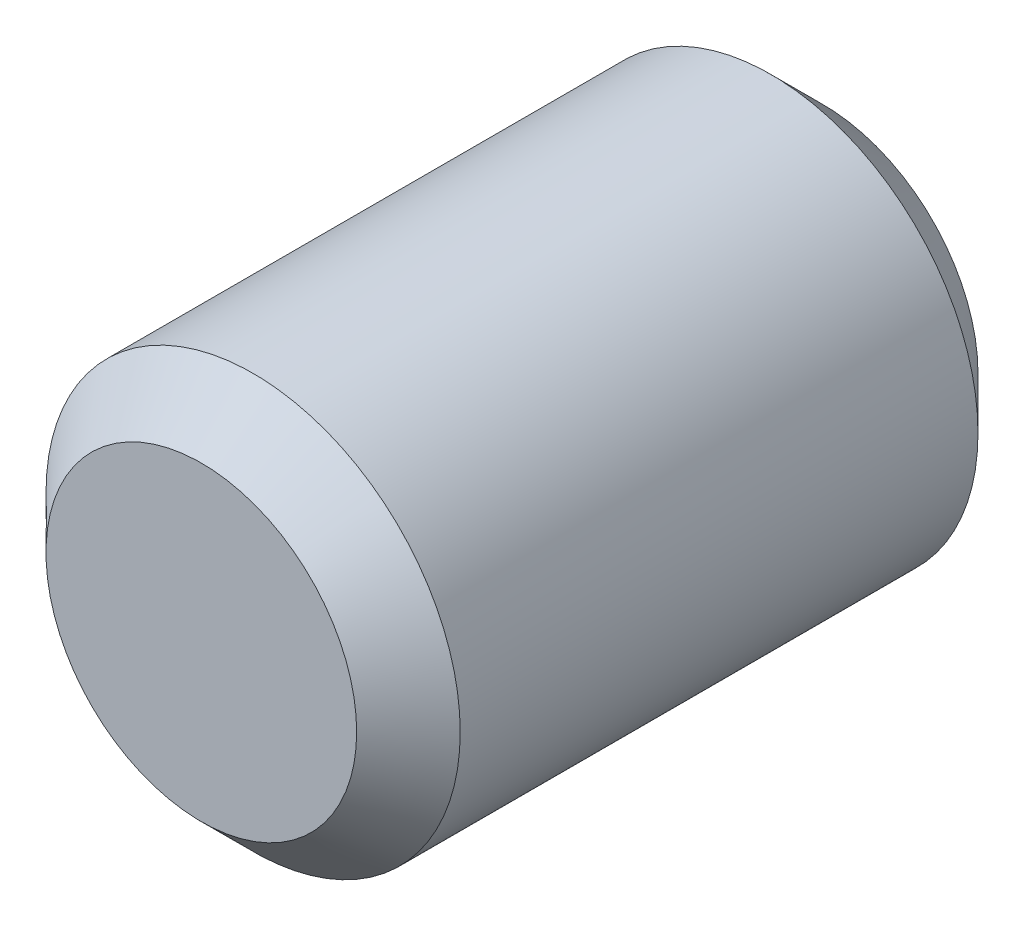
ISO-10303-21;
HEADER;
FILE_DESCRIPTION(('STEP AP214'),'2;1');
FILE_NAME('part.step','',(''),(''),'','','');
FILE_SCHEMA(('AUTOMOTIVE_DESIGN { 1 0 10303 214 1 1 1 1 }'));
ENDSEC;
DATA;
#1=APPLICATION_CONTEXT('core data for automotive mechanical design processes');
#2=APPLICATION_PROTOCOL_DEFINITION('international standard','automotive_design',2000,#1);
#3=PRODUCT_CONTEXT('',#1,'mechanical');
#4=PRODUCT('Part','Part','',(#3));
#5=PRODUCT_RELATED_PRODUCT_CATEGORY('part','',(#4));
#6=PRODUCT_DEFINITION_FORMATION('','',#4);
#7=PRODUCT_DEFINITION_CONTEXT('part definition',#1,'design');
#8=PRODUCT_DEFINITION('design','',#6,#7);
#9=PRODUCT_DEFINITION_SHAPE('','',#8);
#10=(LENGTH_UNIT() NAMED_UNIT(*) SI_UNIT(.MILLI.,.METRE.));
#11=(NAMED_UNIT(*) PLANE_ANGLE_UNIT() SI_UNIT($,.RADIAN.));
#12=(NAMED_UNIT(*) SI_UNIT($,.STERADIAN.) SOLID_ANGLE_UNIT());
#13=UNCERTAINTY_MEASURE_WITH_UNIT(LENGTH_MEASURE(1.E-05),#10,'distance_accuracy_value','');
#14=(GEOMETRIC_REPRESENTATION_CONTEXT(3) GLOBAL_UNCERTAINTY_ASSIGNED_CONTEXT((#13)) GLOBAL_UNIT_ASSIGNED_CONTEXT((#10,
#11,#12)) REPRESENTATION_CONTEXT('',''));
#15=CARTESIAN_POINT('',(0.,0.,0.));
#16=DIRECTION('',(0.,0.,1.));
#17=DIRECTION('',(1.,0.,0.));
#18=AXIS2_PLACEMENT_3D('',#15,#16,#17);
#19=CARTESIAN_POINT('',(0.,0.,6.));
#20=DIRECTION('',(0.,0.,-1.));
#21=DIRECTION('',(-1.,0.,0.));
#22=AXIS2_PLACEMENT_3D('',#19,#20,#21);
#23=CYLINDRICAL_SURFACE('',#22,2.);
#24=CARTESIAN_POINT('',(0.,0.,0.5));
#25=DIRECTION('',(0.,0.,1.));
#26=DIRECTION('',(1.,0.,0.));
#27=AXIS2_PLACEMENT_3D('',#24,#25,#26);
#28=CIRCLE('',#27,2.);
#29=CARTESIAN_POINT('',(2.,0.,0.5));
#30=VERTEX_POINT('',#29);
#31=EDGE_CURVE('E53',#30,#30,#28,.T.);
#32=ORIENTED_EDGE('',*,*,#31,.T.);
#33=EDGE_LOOP('',(#32));
#34=FACE_BOUND('',#33,.T.);
#35=CARTESIAN_POINT('',(0.,0.,5.5));
#36=DIRECTION('',(0.,0.,1.));
#37=DIRECTION('',(1.,0.,0.));
#38=AXIS2_PLACEMENT_3D('',#35,#36,#37);
#39=CIRCLE('',#38,2.);
#40=CARTESIAN_POINT('',(2.,0.,5.5));
#41=VERTEX_POINT('',#40);
#42=EDGE_CURVE('E58',#41,#41,#39,.F.);
#43=ORIENTED_EDGE('',*,*,#42,.T.);
#44=EDGE_LOOP('',(#43));
#45=FACE_BOUND('',#44,.T.);
#46=ADVANCED_FACE('F39',(#34,#45),#23,.T.);
#47=CARTESIAN_POINT('',(0.,0.,6.));
#48=DIRECTION('',(0.,0.,1.));
#49=DIRECTION('',(1.,0.,0.));
#50=AXIS2_PLACEMENT_3D('',#47,#48,#49);
#51=PLANE('',#50);
#52=CARTESIAN_POINT('',(0.,0.,6.));
#53=DIRECTION('',(0.,0.,1.));
#54=DIRECTION('',(1.,0.,0.));
#55=AXIS2_PLACEMENT_3D('',#52,#53,#54);
#56=CIRCLE('',#55,1.5);
#57=CARTESIAN_POINT('',(1.5,0.,6.));
#58=VERTEX_POINT('',#57);
#59=EDGE_CURVE('E10',#58,#58,#56,.T.);
#60=ORIENTED_EDGE('',*,*,#59,.T.);
#61=EDGE_LOOP('',(#60));
#62=FACE_BOUND('',#61,.T.);
#63=ADVANCED_FACE('F75',(#62),#51,.T.);
#64=CARTESIAN_POINT('',(0.,0.,0.));
#65=DIRECTION('',(0.,0.,1.));
#66=DIRECTION('',(1.,0.,0.));
#67=AXIS2_PLACEMENT_3D('',#64,#65,#66);
#68=PLANE('',#67);
#69=CARTESIAN_POINT('',(0.,0.,0.));
#70=DIRECTION('',(0.,0.,1.));
#71=DIRECTION('',(1.,0.,0.));
#72=AXIS2_PLACEMENT_3D('',#69,#70,#71);
#73=CIRCLE('',#72,1.5);
#74=CARTESIAN_POINT('',(1.5,0.,0.));
#75=VERTEX_POINT('',#74);
#76=EDGE_CURVE('E48',#75,#75,#73,.F.);
#77=ORIENTED_EDGE('',*,*,#76,.T.);
#78=EDGE_LOOP('',(#77));
#79=FACE_BOUND('',#78,.T.);
#80=ADVANCED_FACE('F72',(#79),#68,.F.);
#81=CARTESIAN_POINT('',(0.,0.,0.5));
#82=DIRECTION('',(0.,0.,1.));
#83=DIRECTION('',(1.,0.,0.));
#84=AXIS2_PLACEMENT_3D('',#81,#82,#83);
#85=CONICAL_SURFACE('',#84,2.,0.78539816339745);
#86=ORIENTED_EDGE('',*,*,#76,.F.);
#87=EDGE_LOOP('',(#86));
#88=FACE_BOUND('',#87,.T.);
#89=ORIENTED_EDGE('',*,*,#31,.F.);
#90=EDGE_LOOP('',(#89));
#91=FACE_BOUND('',#90,.T.);
#92=ADVANCED_FACE('F68',(#88,#91),#85,.T.);
#93=CARTESIAN_POINT('',(0.,0.,6.));
#94=DIRECTION('',(0.,0.,-1.));
#95=DIRECTION('',(-1.,0.,0.));
#96=AXIS2_PLACEMENT_3D('',#93,#94,#95);
#97=CONICAL_SURFACE('',#96,1.5,0.785398163397446);
#98=ORIENTED_EDGE('',*,*,#42,.F.);
#99=EDGE_LOOP('',(#98));
#100=FACE_BOUND('',#99,.T.);
#101=ORIENTED_EDGE('',*,*,#59,.F.);
#102=EDGE_LOOP('',(#101));
#103=FACE_BOUND('',#102,.T.);
#104=ADVANCED_FACE('F42',(#100,#103),#97,.T.);
#105=CLOSED_SHELL('',(#46,#63,#80,#92,#104));
#106=MANIFOLD_SOLID_BREP('B2',#105);
#107=ADVANCED_BREP_SHAPE_REPRESENTATION('',(#18,#106),#14);
#108=SHAPE_DEFINITION_REPRESENTATION(#9,#107);
ENDSEC;
END-ISO-10303-21;
